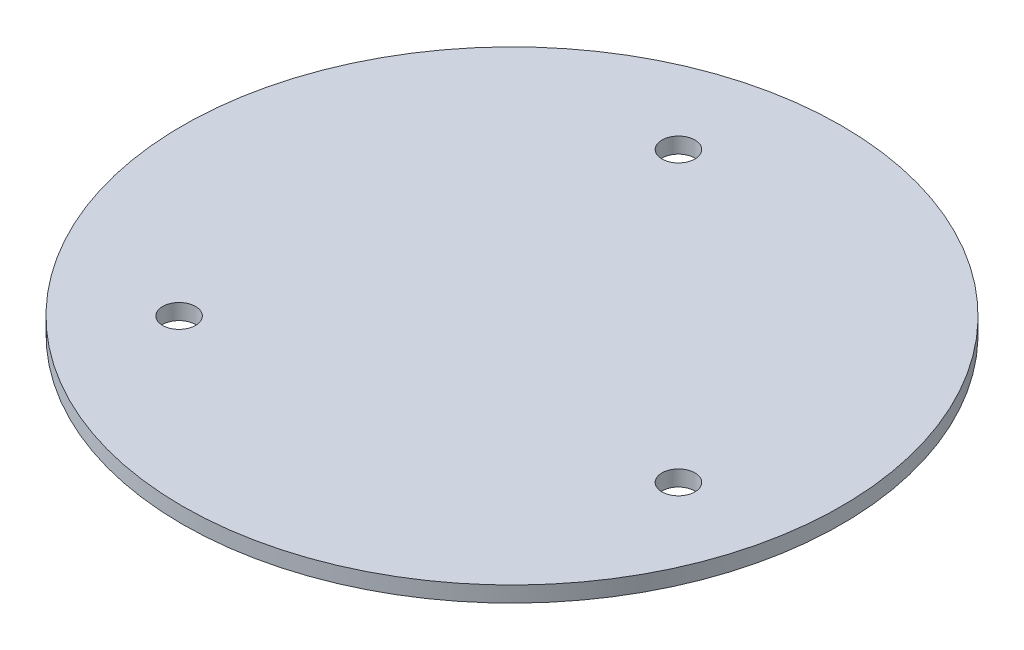
ISO-10303-21;
HEADER;
FILE_DESCRIPTION(('STEP AP214'),'2;1');
FILE_NAME('part.step','',(''),(''),'','','');
FILE_SCHEMA(('AUTOMOTIVE_DESIGN { 1 0 10303 214 1 1 1 1 }'));
ENDSEC;
DATA;
#1=APPLICATION_CONTEXT('core data for automotive mechanical design processes');
#2=APPLICATION_PROTOCOL_DEFINITION('international standard','automotive_design',2000,#1);
#3=PRODUCT_CONTEXT('',#1,'mechanical');
#4=PRODUCT('Part','Part','',(#3));
#5=PRODUCT_RELATED_PRODUCT_CATEGORY('part','',(#4));
#6=PRODUCT_DEFINITION_FORMATION('','',#4);
#7=PRODUCT_DEFINITION_CONTEXT('part definition',#1,'design');
#8=PRODUCT_DEFINITION('design','',#6,#7);
#9=PRODUCT_DEFINITION_SHAPE('','',#8);
#10=(LENGTH_UNIT() NAMED_UNIT(*) SI_UNIT(.MILLI.,.METRE.));
#11=(NAMED_UNIT(*) PLANE_ANGLE_UNIT() SI_UNIT($,.RADIAN.));
#12=(NAMED_UNIT(*) SI_UNIT($,.STERADIAN.) SOLID_ANGLE_UNIT());
#13=UNCERTAINTY_MEASURE_WITH_UNIT(LENGTH_MEASURE(1.E-05),#10,'distance_accuracy_value','');
#14=(GEOMETRIC_REPRESENTATION_CONTEXT(3) GLOBAL_UNCERTAINTY_ASSIGNED_CONTEXT((#13)) GLOBAL_UNIT_ASSIGNED_CONTEXT((#10,
#11,#12)) REPRESENTATION_CONTEXT('',''));
#15=CARTESIAN_POINT('',(0.,0.,0.));
#16=DIRECTION('',(0.,0.,1.));
#17=DIRECTION('',(1.,0.,0.));
#18=AXIS2_PLACEMENT_3D('',#15,#16,#17);
#19=CARTESIAN_POINT('',(0.,0.,0.));
#20=DIRECTION('',(0.,1.,0.));
#21=DIRECTION('',(0.,0.,1.));
#22=AXIS2_PLACEMENT_3D('',#19,#20,#21);
#23=PLANE('',#22);
#24=CARTESIAN_POINT('',(-21.2132034355964,0.,21.2132034355964));
#25=DIRECTION('',(0.,1.,0.));
#26=DIRECTION('',(0.,0.,1.));
#27=AXIS2_PLACEMENT_3D('',#24,#25,#26);
#28=CIRCLE('',#27,2.1);
#29=CARTESIAN_POINT('',(-21.2132034355964,0.,23.3132034355964));
#30=VERTEX_POINT('',#29);
#31=EDGE_CURVE('E34',#30,#30,#28,.T.);
#32=ORIENTED_EDGE('',*,*,#31,.T.);
#33=EDGE_LOOP('',(#32));
#34=FACE_BOUND('',#33,.T.);
#35=CARTESIAN_POINT('',(-7.7645713530756,0.,-28.977774788672));
#36=DIRECTION('',(0.,1.,0.));
#37=DIRECTION('',(0.,0.,1.));
#38=AXIS2_PLACEMENT_3D('',#35,#36,#37);
#39=CIRCLE('',#38,2.1);
#40=CARTESIAN_POINT('',(-7.7645713530756,0.,-26.877774788672));
#41=VERTEX_POINT('',#40);
#42=EDGE_CURVE('E39',#41,#41,#39,.T.);
#43=ORIENTED_EDGE('',*,*,#42,.T.);
#44=EDGE_LOOP('',(#43));
#45=FACE_BOUND('',#44,.T.);
#46=CARTESIAN_POINT('',(28.977774788672,0.,7.76457135307563));
#47=DIRECTION('',(0.,1.,0.));
#48=DIRECTION('',(0.,0.,1.));
#49=AXIS2_PLACEMENT_3D('',#46,#47,#48);
#50=CIRCLE('',#49,2.1);
#51=CARTESIAN_POINT('',(28.977774788672,0.,9.86457135307563));
#52=VERTEX_POINT('',#51);
#53=EDGE_CURVE('E37',#52,#52,#50,.T.);
#54=ORIENTED_EDGE('',*,*,#53,.T.);
#55=EDGE_LOOP('',(#54));
#56=FACE_BOUND('',#55,.T.);
#57=CARTESIAN_POINT('',(0.,0.,0.));
#58=DIRECTION('',(0.,1.,0.));
#59=DIRECTION('',(0.,0.,1.));
#60=AXIS2_PLACEMENT_3D('',#57,#58,#59);
#61=CIRCLE('',#60,42.);
#62=CARTESIAN_POINT('',(0.,0.,42.));
#63=VERTEX_POINT('',#62);
#64=EDGE_CURVE('E17',#63,#63,#61,.T.);
#65=ORIENTED_EDGE('',*,*,#64,.F.);
#66=EDGE_LOOP('',(#65));
#67=FACE_BOUND('',#66,.T.);
#68=ADVANCED_FACE('F14',(#34,#45,#56,#67),#23,.F.);
#69=CARTESIAN_POINT('',(0.,0.,0.));
#70=DIRECTION('',(0.,1.,0.));
#71=DIRECTION('',(0.,0.,1.));
#72=AXIS2_PLACEMENT_3D('',#69,#70,#71);
#73=CYLINDRICAL_SURFACE('',#72,42.);
#74=ORIENTED_EDGE('',*,*,#64,.T.);
#75=EDGE_LOOP('',(#74));
#76=FACE_BOUND('',#75,.T.);
#77=CARTESIAN_POINT('',(0.,2.,0.));
#78=DIRECTION('',(0.,1.,0.));
#79=DIRECTION('',(0.,0.,1.));
#80=AXIS2_PLACEMENT_3D('',#77,#78,#79);
#81=CIRCLE('',#80,42.);
#82=CARTESIAN_POINT('',(0.,2.,42.));
#83=VERTEX_POINT('',#82);
#84=EDGE_CURVE('E31',#83,#83,#81,.T.);
#85=ORIENTED_EDGE('',*,*,#84,.F.);
#86=EDGE_LOOP('',(#85));
#87=FACE_BOUND('',#86,.T.);
#88=ADVANCED_FACE('F46',(#76,#87),#73,.T.);
#89=CARTESIAN_POINT('',(-7.7645713530756,0.,-28.977774788672));
#90=DIRECTION('',(0.,1.,0.));
#91=DIRECTION('',(0.,0.,1.));
#92=AXIS2_PLACEMENT_3D('',#89,#90,#91);
#93=CYLINDRICAL_SURFACE('',#92,2.1);
#94=CARTESIAN_POINT('',(-7.7645713530756,2.,-28.977774788672));
#95=DIRECTION('',(0.,1.,0.));
#96=DIRECTION('',(0.,0.,1.));
#97=AXIS2_PLACEMENT_3D('',#94,#95,#96);
#98=CIRCLE('',#97,2.1);
#99=CARTESIAN_POINT('',(-7.7645713530756,2.,-26.877774788672));
#100=VERTEX_POINT('',#99);
#101=EDGE_CURVE('E26',#100,#100,#98,.F.);
#102=ORIENTED_EDGE('',*,*,#101,.F.);
#103=EDGE_LOOP('',(#102));
#104=FACE_BOUND('',#103,.T.);
#105=ORIENTED_EDGE('',*,*,#42,.F.);
#106=EDGE_LOOP('',(#105));
#107=FACE_BOUND('',#106,.T.);
#108=ADVANCED_FACE('F55',(#104,#107),#93,.F.);
#109=CARTESIAN_POINT('',(28.977774788672,0.,7.76457135307563));
#110=DIRECTION('',(0.,1.,0.));
#111=DIRECTION('',(0.,0.,1.));
#112=AXIS2_PLACEMENT_3D('',#109,#110,#111);
#113=CYLINDRICAL_SURFACE('',#112,2.1);
#114=CARTESIAN_POINT('',(28.977774788672,2.,7.76457135307563));
#115=DIRECTION('',(0.,1.,0.));
#116=DIRECTION('',(0.,0.,1.));
#117=AXIS2_PLACEMENT_3D('',#114,#115,#116);
#118=CIRCLE('',#117,2.1);
#119=CARTESIAN_POINT('',(28.977774788672,2.,9.86457135307563));
#120=VERTEX_POINT('',#119);
#121=EDGE_CURVE('E21',#120,#120,#118,.F.);
#122=ORIENTED_EDGE('',*,*,#121,.F.);
#123=EDGE_LOOP('',(#122));
#124=FACE_BOUND('',#123,.T.);
#125=ORIENTED_EDGE('',*,*,#53,.F.);
#126=EDGE_LOOP('',(#125));
#127=FACE_BOUND('',#126,.T.);
#128=ADVANCED_FACE('F63',(#124,#127),#113,.F.);
#129=CARTESIAN_POINT('',(-21.2132034355964,0.,21.2132034355964));
#130=DIRECTION('',(0.,1.,0.));
#131=DIRECTION('',(0.,0.,1.));
#132=AXIS2_PLACEMENT_3D('',#129,#130,#131);
#133=CYLINDRICAL_SURFACE('',#132,2.1);
#134=ORIENTED_EDGE('',*,*,#31,.F.);
#135=EDGE_LOOP('',(#134));
#136=FACE_BOUND('',#135,.T.);
#137=CARTESIAN_POINT('',(-21.2132034355964,2.,21.2132034355964));
#138=DIRECTION('',(0.,1.,0.));
#139=DIRECTION('',(0.,0.,1.));
#140=AXIS2_PLACEMENT_3D('',#137,#138,#139);
#141=CIRCLE('',#140,2.1);
#142=CARTESIAN_POINT('',(-21.2132034355964,2.,23.3132034355964));
#143=VERTEX_POINT('',#142);
#144=EDGE_CURVE('E9',#143,#143,#141,.F.);
#145=ORIENTED_EDGE('',*,*,#144,.F.);
#146=EDGE_LOOP('',(#145));
#147=FACE_BOUND('',#146,.T.);
#148=ADVANCED_FACE('F58',(#136,#147),#133,.F.);
#149=CARTESIAN_POINT('',(0.,2.,0.));
#150=DIRECTION('',(0.,1.,0.));
#151=DIRECTION('',(0.,0.,1.));
#152=AXIS2_PLACEMENT_3D('',#149,#150,#151);
#153=PLANE('',#152);
#154=ORIENTED_EDGE('',*,*,#144,.T.);
#155=EDGE_LOOP('',(#154));
#156=FACE_BOUND('',#155,.T.);
#157=ORIENTED_EDGE('',*,*,#121,.T.);
#158=EDGE_LOOP('',(#157));
#159=FACE_BOUND('',#158,.T.);
#160=ORIENTED_EDGE('',*,*,#101,.T.);
#161=EDGE_LOOP('',(#160));
#162=FACE_BOUND('',#161,.T.);
#163=ORIENTED_EDGE('',*,*,#84,.T.);
#164=EDGE_LOOP('',(#163));
#165=FACE_BOUND('',#164,.T.);
#166=ADVANCED_FACE('F56',(#156,#159,#162,#165),#153,.T.);
#167=CLOSED_SHELL('',(#68,#88,#108,#128,#148,#166));
#168=MANIFOLD_SOLID_BREP('B1',#167);
#169=ADVANCED_BREP_SHAPE_REPRESENTATION('',(#18,#168),#14);
#170=SHAPE_DEFINITION_REPRESENTATION(#9,#169);
ENDSEC;
END-ISO-10303-21;
